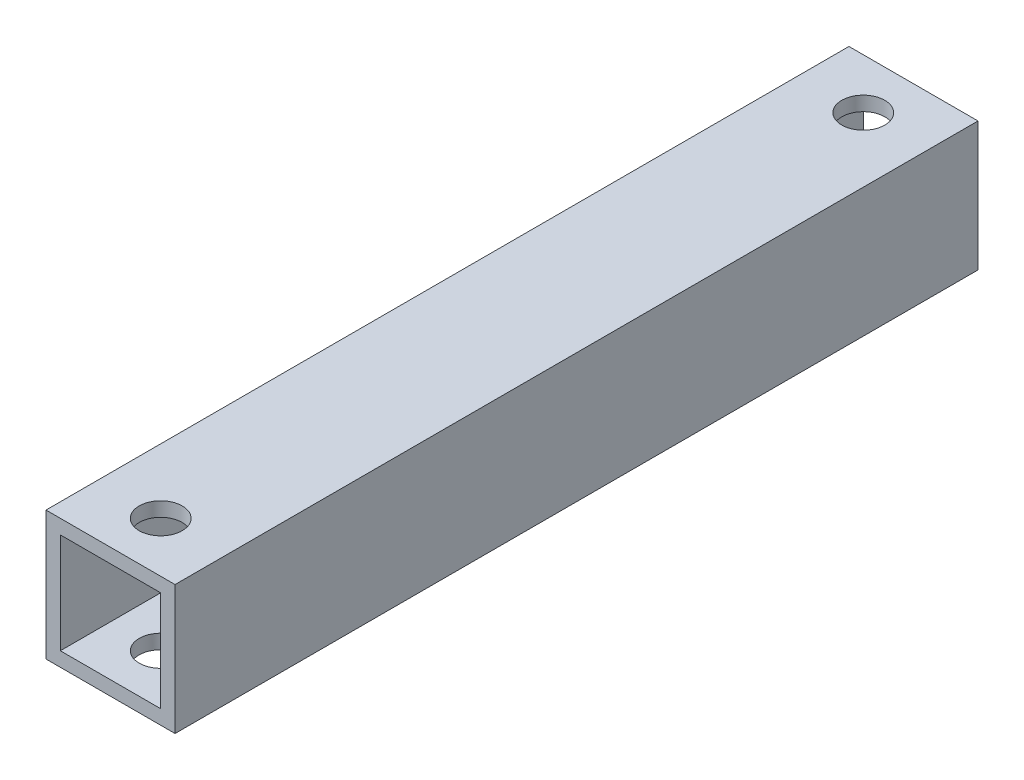
ISO-10303-21;
HEADER;
FILE_DESCRIPTION(('STEP AP214'),'2;1');
FILE_NAME('part.step','',(''),(''),'','','');
FILE_SCHEMA(('AUTOMOTIVE_DESIGN { 1 0 10303 214 1 1 1 1 }'));
ENDSEC;
DATA;
#1=APPLICATION_CONTEXT('core data for automotive mechanical design processes');
#2=APPLICATION_PROTOCOL_DEFINITION('international standard','automotive_design',2000,#1);
#3=PRODUCT_CONTEXT('',#1,'mechanical');
#4=PRODUCT('Part','Part','',(#3));
#5=PRODUCT_RELATED_PRODUCT_CATEGORY('part','',(#4));
#6=PRODUCT_DEFINITION_FORMATION('','',#4);
#7=PRODUCT_DEFINITION_CONTEXT('part definition',#1,'design');
#8=PRODUCT_DEFINITION('design','',#6,#7);
#9=PRODUCT_DEFINITION_SHAPE('','',#8);
#10=(LENGTH_UNIT() NAMED_UNIT(*) SI_UNIT(.MILLI.,.METRE.));
#11=(NAMED_UNIT(*) PLANE_ANGLE_UNIT() SI_UNIT($,.RADIAN.));
#12=(NAMED_UNIT(*) SI_UNIT($,.STERADIAN.) SOLID_ANGLE_UNIT());
#13=UNCERTAINTY_MEASURE_WITH_UNIT(LENGTH_MEASURE(1.E-05),#10,'distance_accuracy_value','');
#14=(GEOMETRIC_REPRESENTATION_CONTEXT(3) GLOBAL_UNCERTAINTY_ASSIGNED_CONTEXT((#13)) GLOBAL_UNIT_ASSIGNED_CONTEXT((#10,
#11,#12)) REPRESENTATION_CONTEXT('',''));
#15=CARTESIAN_POINT('',(0.,0.,0.));
#16=DIRECTION('',(0.,0.,1.));
#17=DIRECTION('',(1.,0.,0.));
#18=AXIS2_PLACEMENT_3D('',#15,#16,#17);
#19=CARTESIAN_POINT('',(4.5,4.5,56.));
#20=DIRECTION('',(-1.,0.,0.));
#21=DIRECTION('',(0.,0.,1.));
#22=AXIS2_PLACEMENT_3D('',#19,#20,#21);
#23=PLANE('',#22);
#24=DIRECTION('',(0.,1.,0.));
#25=VECTOR('',#24,1.);
#26=CARTESIAN_POINT('',(4.5,4.5,0.));
#27=LINE('',#26,#25);
#28=CARTESIAN_POINT('',(4.5,-4.5,0.));
#29=VERTEX_POINT('',#28);
#30=CARTESIAN_POINT('',(4.5,4.5,0.));
#31=VERTEX_POINT('',#30);
#32=EDGE_CURVE('E135',#29,#31,#27,.T.);
#33=ORIENTED_EDGE('',*,*,#32,.T.);
#34=DIRECTION('',(0.,0.,-1.));
#35=VECTOR('',#34,1.);
#36=CARTESIAN_POINT('',(4.5,4.5,56.));
#37=LINE('',#36,#35);
#38=CARTESIAN_POINT('',(4.5,4.5,56.));
#39=VERTEX_POINT('',#38);
#40=EDGE_CURVE('E11',#39,#31,#37,.T.);
#41=ORIENTED_EDGE('',*,*,#40,.F.);
#42=DIRECTION('',(0.,1.,0.));
#43=VECTOR('',#42,1.);
#44=CARTESIAN_POINT('',(4.5,4.5,56.));
#45=LINE('',#44,#43);
#46=CARTESIAN_POINT('',(4.5,-4.5,56.));
#47=VERTEX_POINT('',#46);
#48=EDGE_CURVE('E139',#47,#39,#45,.T.);
#49=ORIENTED_EDGE('',*,*,#48,.F.);
#50=DIRECTION('',(0.,0.,-1.));
#51=VECTOR('',#50,1.);
#52=CARTESIAN_POINT('',(4.5,-4.5,56.));
#53=LINE('',#52,#51);
#54=EDGE_CURVE('E149',#47,#29,#53,.T.);
#55=ORIENTED_EDGE('',*,*,#54,.T.);
#56=EDGE_LOOP('',(#33,#41,#49,#55));
#57=FACE_BOUND('',#56,.T.);
#58=ADVANCED_FACE('F33',(#57),#23,.F.);
#59=CARTESIAN_POINT('',(-4.5,4.5,56.));
#60=DIRECTION('',(0.,-1.,0.));
#61=DIRECTION('',(0.,0.,-1.));
#62=AXIS2_PLACEMENT_3D('',#59,#60,#61);
#63=PLANE('',#62);
#64=CARTESIAN_POINT('',(0.,4.5,3.5));
#65=DIRECTION('',(0.,1.,0.));
#66=DIRECTION('',(0.,0.,1.));
#67=AXIS2_PLACEMENT_3D('',#64,#65,#66);
#68=CIRCLE('',#67,1.5);
#69=CARTESIAN_POINT('',(0.,4.5,5.));
#70=VERTEX_POINT('',#69);
#71=EDGE_CURVE('E166',#70,#70,#68,.T.);
#72=ORIENTED_EDGE('',*,*,#71,.F.);
#73=EDGE_LOOP('',(#72));
#74=FACE_BOUND('',#73,.T.);
#75=CARTESIAN_POINT('',(0.,4.5,52.5));
#76=DIRECTION('',(0.,1.,0.));
#77=DIRECTION('',(0.,0.,1.));
#78=AXIS2_PLACEMENT_3D('',#75,#76,#77);
#79=CIRCLE('',#78,1.5);
#80=CARTESIAN_POINT('',(0.,4.5,54.));
#81=VERTEX_POINT('',#80);
#82=EDGE_CURVE('E173',#81,#81,#79,.T.);
#83=ORIENTED_EDGE('',*,*,#82,.F.);
#84=EDGE_LOOP('',(#83));
#85=FACE_BOUND('',#84,.T.);
#86=DIRECTION('',(-1.,0.,0.));
#87=VECTOR('',#86,1.);
#88=CARTESIAN_POINT('',(-4.5,4.5,0.));
#89=LINE('',#88,#87);
#90=CARTESIAN_POINT('',(-4.5,4.5,0.));
#91=VERTEX_POINT('',#90);
#92=EDGE_CURVE('E152',#31,#91,#89,.T.);
#93=ORIENTED_EDGE('',*,*,#92,.T.);
#94=DIRECTION('',(0.,0.,-1.));
#95=VECTOR('',#94,1.);
#96=CARTESIAN_POINT('',(-4.5,4.5,56.));
#97=LINE('',#96,#95);
#98=CARTESIAN_POINT('',(-4.5,4.5,56.));
#99=VERTEX_POINT('',#98);
#100=EDGE_CURVE('E41',#99,#91,#97,.T.);
#101=ORIENTED_EDGE('',*,*,#100,.F.);
#102=DIRECTION('',(-1.,0.,0.));
#103=VECTOR('',#102,1.);
#104=CARTESIAN_POINT('',(-4.5,4.5,56.));
#105=LINE('',#104,#103);
#106=EDGE_CURVE('E142',#39,#99,#105,.T.);
#107=ORIENTED_EDGE('',*,*,#106,.F.);
#108=ORIENTED_EDGE('',*,*,#40,.T.);
#109=EDGE_LOOP('',(#93,#101,#107,#108));
#110=FACE_BOUND('',#109,.T.);
#111=ADVANCED_FACE('F206',(#74,#85,#110),#63,.F.);
#112=CARTESIAN_POINT('',(-4.5,4.5,56.));
#113=DIRECTION('',(1.,0.,0.));
#114=DIRECTION('',(0.,1.,0.));
#115=AXIS2_PLACEMENT_3D('',#112,#113,#114);
#116=PLANE('',#115);
#117=DIRECTION('',(0.,-1.,0.));
#118=VECTOR('',#117,1.);
#119=CARTESIAN_POINT('',(-4.5,4.5,0.));
#120=LINE('',#119,#118);
#121=CARTESIAN_POINT('',(-4.5,-4.5,0.));
#122=VERTEX_POINT('',#121);
#123=EDGE_CURVE('E154',#91,#122,#120,.T.);
#124=ORIENTED_EDGE('',*,*,#123,.T.);
#125=DIRECTION('',(0.,0.,-1.));
#126=VECTOR('',#125,1.);
#127=CARTESIAN_POINT('',(-4.5,-4.5,56.));
#128=LINE('',#127,#126);
#129=CARTESIAN_POINT('',(-4.5,-4.5,56.));
#130=VERTEX_POINT('',#129);
#131=EDGE_CURVE('E159',#130,#122,#128,.T.);
#132=ORIENTED_EDGE('',*,*,#131,.F.);
#133=DIRECTION('',(0.,-1.,0.));
#134=VECTOR('',#133,1.);
#135=CARTESIAN_POINT('',(-4.5,4.5,56.));
#136=LINE('',#135,#134);
#137=EDGE_CURVE('E145',#99,#130,#136,.T.);
#138=ORIENTED_EDGE('',*,*,#137,.F.);
#139=ORIENTED_EDGE('',*,*,#100,.T.);
#140=EDGE_LOOP('',(#124,#132,#138,#139));
#141=FACE_BOUND('',#140,.T.);
#142=ADVANCED_FACE('F211',(#141),#116,.F.);
#143=CARTESIAN_POINT('',(-4.5,-4.5,56.));
#144=DIRECTION('',(0.,1.,0.));
#145=DIRECTION('',(0.,0.,1.));
#146=AXIS2_PLACEMENT_3D('',#143,#144,#145);
#147=PLANE('',#146);
#148=CARTESIAN_POINT('',(0.,-4.5,3.5));
#149=DIRECTION('',(0.,1.,0.));
#150=DIRECTION('',(0.,0.,1.));
#151=AXIS2_PLACEMENT_3D('',#148,#149,#150);
#152=CIRCLE('',#151,1.5);
#153=CARTESIAN_POINT('',(0.,-4.5,5.));
#154=VERTEX_POINT('',#153);
#155=EDGE_CURVE('E123',#154,#154,#152,.T.);
#156=ORIENTED_EDGE('',*,*,#155,.T.);
#157=EDGE_LOOP('',(#156));
#158=FACE_BOUND('',#157,.T.);
#159=CARTESIAN_POINT('',(0.,-4.5,52.5));
#160=DIRECTION('',(0.,1.,0.));
#161=DIRECTION('',(0.,0.,1.));
#162=AXIS2_PLACEMENT_3D('',#159,#160,#161);
#163=CIRCLE('',#162,1.5);
#164=CARTESIAN_POINT('',(0.,-4.5,54.));
#165=VERTEX_POINT('',#164);
#166=EDGE_CURVE('E170',#165,#165,#163,.T.);
#167=ORIENTED_EDGE('',*,*,#166,.T.);
#168=EDGE_LOOP('',(#167));
#169=FACE_BOUND('',#168,.T.);
#170=DIRECTION('',(1.,0.,0.));
#171=VECTOR('',#170,1.);
#172=CARTESIAN_POINT('',(-4.5,-4.5,0.));
#173=LINE('',#172,#171);
#174=EDGE_CURVE('E143',#122,#29,#173,.T.);
#175=ORIENTED_EDGE('',*,*,#174,.T.);
#176=ORIENTED_EDGE('',*,*,#54,.F.);
#177=DIRECTION('',(1.,0.,0.));
#178=VECTOR('',#177,1.);
#179=CARTESIAN_POINT('',(-4.5,-4.5,56.));
#180=LINE('',#179,#178);
#181=EDGE_CURVE('E147',#130,#47,#180,.T.);
#182=ORIENTED_EDGE('',*,*,#181,.F.);
#183=ORIENTED_EDGE('',*,*,#131,.T.);
#184=EDGE_LOOP('',(#175,#176,#182,#183));
#185=FACE_BOUND('',#184,.T.);
#186=ADVANCED_FACE('F227',(#158,#169,#185),#147,.F.);
#187=CARTESIAN_POINT('',(0.,0.,56.));
#188=DIRECTION('',(0.,0.,1.));
#189=DIRECTION('',(1.,0.,0.));
#190=AXIS2_PLACEMENT_3D('',#187,#188,#189);
#191=PLANE('',#190);
#192=DIRECTION('',(0.,1.,0.));
#193=VECTOR('',#192,1.);
#194=CARTESIAN_POINT('',(3.5,3.5,56.));
#195=LINE('',#194,#193);
#196=CARTESIAN_POINT('',(3.5,-3.5,56.));
#197=VERTEX_POINT('',#196);
#198=CARTESIAN_POINT('',(3.5,3.5,56.));
#199=VERTEX_POINT('',#198);
#200=EDGE_CURVE('E49',#197,#199,#195,.T.);
#201=ORIENTED_EDGE('',*,*,#200,.F.);
#202=DIRECTION('',(1.,0.,0.));
#203=VECTOR('',#202,1.);
#204=CARTESIAN_POINT('',(-3.5,-3.5,56.));
#205=LINE('',#204,#203);
#206=CARTESIAN_POINT('',(-3.5,-3.5,56.));
#207=VERTEX_POINT('',#206);
#208=EDGE_CURVE('E117',#207,#197,#205,.T.);
#209=ORIENTED_EDGE('',*,*,#208,.F.);
#210=DIRECTION('',(0.,-1.,0.));
#211=VECTOR('',#210,1.);
#212=CARTESIAN_POINT('',(-3.5,3.5,56.));
#213=LINE('',#212,#211);
#214=CARTESIAN_POINT('',(-3.5,3.5,56.));
#215=VERTEX_POINT('',#214);
#216=EDGE_CURVE('E120',#215,#207,#213,.T.);
#217=ORIENTED_EDGE('',*,*,#216,.F.);
#218=DIRECTION('',(-1.,0.,0.));
#219=VECTOR('',#218,1.);
#220=CARTESIAN_POINT('',(-3.5,3.5,56.));
#221=LINE('',#220,#219);
#222=EDGE_CURVE('E129',#199,#215,#221,.T.);
#223=ORIENTED_EDGE('',*,*,#222,.F.);
#224=EDGE_LOOP('',(#201,#209,#217,#223));
#225=FACE_BOUND('',#224,.T.);
#226=ORIENTED_EDGE('',*,*,#48,.T.);
#227=ORIENTED_EDGE('',*,*,#106,.T.);
#228=ORIENTED_EDGE('',*,*,#137,.T.);
#229=ORIENTED_EDGE('',*,*,#181,.T.);
#230=EDGE_LOOP('',(#226,#227,#228,#229));
#231=FACE_BOUND('',#230,.T.);
#232=ADVANCED_FACE('F223',(#225,#231),#191,.T.);
#233=CARTESIAN_POINT('',(0.,0.,0.));
#234=DIRECTION('',(0.,0.,1.));
#235=DIRECTION('',(1.,0.,0.));
#236=AXIS2_PLACEMENT_3D('',#233,#234,#235);
#237=PLANE('',#236);
#238=DIRECTION('',(1.,0.,0.));
#239=VECTOR('',#238,1.);
#240=CARTESIAN_POINT('',(-3.5,-3.5,0.));
#241=LINE('',#240,#239);
#242=CARTESIAN_POINT('',(-3.5,-3.5,0.));
#243=VERTEX_POINT('',#242);
#244=CARTESIAN_POINT('',(3.5,-3.5,0.));
#245=VERTEX_POINT('',#244);
#246=EDGE_CURVE('E107',#243,#245,#241,.T.);
#247=ORIENTED_EDGE('',*,*,#246,.T.);
#248=DIRECTION('',(0.,1.,0.));
#249=VECTOR('',#248,1.);
#250=CARTESIAN_POINT('',(3.5,3.5,0.));
#251=LINE('',#250,#249);
#252=CARTESIAN_POINT('',(3.5,3.5,0.));
#253=VERTEX_POINT('',#252);
#254=EDGE_CURVE('E101',#245,#253,#251,.T.);
#255=ORIENTED_EDGE('',*,*,#254,.T.);
#256=DIRECTION('',(-1.,0.,0.));
#257=VECTOR('',#256,1.);
#258=CARTESIAN_POINT('',(-3.5,3.5,0.));
#259=LINE('',#258,#257);
#260=CARTESIAN_POINT('',(-3.5,3.5,0.));
#261=VERTEX_POINT('',#260);
#262=EDGE_CURVE('E110',#253,#261,#259,.T.);
#263=ORIENTED_EDGE('',*,*,#262,.T.);
#264=DIRECTION('',(0.,-1.,0.));
#265=VECTOR('',#264,1.);
#266=CARTESIAN_POINT('',(-3.5,3.5,0.));
#267=LINE('',#266,#265);
#268=EDGE_CURVE('E57',#261,#243,#267,.T.);
#269=ORIENTED_EDGE('',*,*,#268,.T.);
#270=EDGE_LOOP('',(#247,#255,#263,#269));
#271=FACE_BOUND('',#270,.T.);
#272=ORIENTED_EDGE('',*,*,#32,.F.);
#273=ORIENTED_EDGE('',*,*,#174,.F.);
#274=ORIENTED_EDGE('',*,*,#123,.F.);
#275=ORIENTED_EDGE('',*,*,#92,.F.);
#276=EDGE_LOOP('',(#272,#273,#274,#275));
#277=FACE_BOUND('',#276,.T.);
#278=ADVANCED_FACE('F114',(#271,#277),#237,.F.);
#279=CARTESIAN_POINT('',(3.5,3.5,0.));
#280=DIRECTION('',(1.,0.,0.));
#281=DIRECTION('',(0.,1.,0.));
#282=AXIS2_PLACEMENT_3D('',#279,#280,#281);
#283=PLANE('',#282);
#284=ORIENTED_EDGE('',*,*,#200,.T.);
#285=DIRECTION('',(0.,0.,1.));
#286=VECTOR('',#285,1.);
#287=CARTESIAN_POINT('',(3.5,3.5,0.));
#288=LINE('',#287,#286);
#289=EDGE_CURVE('E97',#253,#199,#288,.T.);
#290=ORIENTED_EDGE('',*,*,#289,.F.);
#291=ORIENTED_EDGE('',*,*,#254,.F.);
#292=DIRECTION('',(0.,0.,1.));
#293=VECTOR('',#292,1.);
#294=CARTESIAN_POINT('',(3.5,-3.5,0.));
#295=LINE('',#294,#293);
#296=EDGE_CURVE('E133',#245,#197,#295,.T.);
#297=ORIENTED_EDGE('',*,*,#296,.T.);
#298=EDGE_LOOP('',(#284,#290,#291,#297));
#299=FACE_BOUND('',#298,.T.);
#300=ADVANCED_FACE('F99',(#299),#283,.F.);
#301=CARTESIAN_POINT('',(-3.5,-3.5,0.));
#302=DIRECTION('',(0.,-1.,0.));
#303=DIRECTION('',(0.,0.,-1.));
#304=AXIS2_PLACEMENT_3D('',#301,#302,#303);
#305=PLANE('',#304);
#306=CARTESIAN_POINT('',(0.,-3.5,3.5));
#307=DIRECTION('',(0.,-1.,0.));
#308=DIRECTION('',(0.,0.,-1.));
#309=AXIS2_PLACEMENT_3D('',#306,#307,#308);
#310=CIRCLE('',#309,1.5);
#311=CARTESIAN_POINT('',(0.,-3.5,2.));
#312=VERTEX_POINT('',#311);
#313=EDGE_CURVE('E181',#312,#312,#310,.T.);
#314=ORIENTED_EDGE('',*,*,#313,.T.);
#315=EDGE_LOOP('',(#314));
#316=FACE_BOUND('',#315,.T.);
#317=CARTESIAN_POINT('',(0.,-3.5,52.5));
#318=DIRECTION('',(0.,-1.,0.));
#319=DIRECTION('',(0.,0.,-1.));
#320=AXIS2_PLACEMENT_3D('',#317,#318,#319);
#321=CIRCLE('',#320,1.5);
#322=CARTESIAN_POINT('',(0.,-3.5,51.));
#323=VERTEX_POINT('',#322);
#324=EDGE_CURVE('E165',#323,#323,#321,.T.);
#325=ORIENTED_EDGE('',*,*,#324,.T.);
#326=EDGE_LOOP('',(#325));
#327=FACE_BOUND('',#326,.T.);
#328=ORIENTED_EDGE('',*,*,#208,.T.);
#329=ORIENTED_EDGE('',*,*,#296,.F.);
#330=ORIENTED_EDGE('',*,*,#246,.F.);
#331=DIRECTION('',(0.,0.,1.));
#332=VECTOR('',#331,1.);
#333=CARTESIAN_POINT('',(-3.5,-3.5,0.));
#334=LINE('',#333,#332);
#335=EDGE_CURVE('E136',#243,#207,#334,.T.);
#336=ORIENTED_EDGE('',*,*,#335,.T.);
#337=EDGE_LOOP('',(#328,#329,#330,#336));
#338=FACE_BOUND('',#337,.T.);
#339=ADVANCED_FACE('F244',(#316,#327,#338),#305,.F.);
#340=CARTESIAN_POINT('',(-3.5,3.5,0.));
#341=DIRECTION('',(-1.,0.,0.));
#342=DIRECTION('',(0.,-1.,0.));
#343=AXIS2_PLACEMENT_3D('',#340,#341,#342);
#344=PLANE('',#343);
#345=ORIENTED_EDGE('',*,*,#216,.T.);
#346=ORIENTED_EDGE('',*,*,#335,.F.);
#347=ORIENTED_EDGE('',*,*,#268,.F.);
#348=DIRECTION('',(0.,0.,1.));
#349=VECTOR('',#348,1.);
#350=CARTESIAN_POINT('',(-3.5,3.5,0.));
#351=LINE('',#350,#349);
#352=EDGE_CURVE('E106',#261,#215,#351,.T.);
#353=ORIENTED_EDGE('',*,*,#352,.T.);
#354=EDGE_LOOP('',(#345,#346,#347,#353));
#355=FACE_BOUND('',#354,.T.);
#356=ADVANCED_FACE('F247',(#355),#344,.F.);
#357=CARTESIAN_POINT('',(-3.5,3.5,0.));
#358=DIRECTION('',(0.,1.,0.));
#359=DIRECTION('',(0.,0.,1.));
#360=AXIS2_PLACEMENT_3D('',#357,#358,#359);
#361=PLANE('',#360);
#362=CARTESIAN_POINT('',(0.,3.5,3.5));
#363=DIRECTION('',(0.,1.,0.));
#364=DIRECTION('',(0.,0.,1.));
#365=AXIS2_PLACEMENT_3D('',#362,#363,#364);
#366=CIRCLE('',#365,1.5);
#367=CARTESIAN_POINT('',(0.,3.5,5.));
#368=VERTEX_POINT('',#367);
#369=EDGE_CURVE('E36',#368,#368,#366,.T.);
#370=ORIENTED_EDGE('',*,*,#369,.T.);
#371=EDGE_LOOP('',(#370));
#372=FACE_BOUND('',#371,.T.);
#373=CARTESIAN_POINT('',(0.,3.5,52.5));
#374=DIRECTION('',(0.,1.,0.));
#375=DIRECTION('',(0.,0.,1.));
#376=AXIS2_PLACEMENT_3D('',#373,#374,#375);
#377=CIRCLE('',#376,1.5);
#378=CARTESIAN_POINT('',(0.,3.5,54.));
#379=VERTEX_POINT('',#378);
#380=EDGE_CURVE('E163',#379,#379,#377,.T.);
#381=ORIENTED_EDGE('',*,*,#380,.T.);
#382=EDGE_LOOP('',(#381));
#383=FACE_BOUND('',#382,.T.);
#384=ORIENTED_EDGE('',*,*,#222,.T.);
#385=ORIENTED_EDGE('',*,*,#352,.F.);
#386=ORIENTED_EDGE('',*,*,#262,.F.);
#387=ORIENTED_EDGE('',*,*,#289,.T.);
#388=EDGE_LOOP('',(#384,#385,#386,#387));
#389=FACE_BOUND('',#388,.T.);
#390=ADVANCED_FACE('F111',(#372,#383,#389),#361,.F.);
#391=CARTESIAN_POINT('',(0.,-51.5,52.5));
#392=DIRECTION('',(0.,1.,0.));
#393=DIRECTION('',(0.,0.,1.));
#394=AXIS2_PLACEMENT_3D('',#391,#392,#393);
#395=CYLINDRICAL_SURFACE('',#394,1.5);
#396=ORIENTED_EDGE('',*,*,#82,.T.);
#397=EDGE_LOOP('',(#396));
#398=FACE_BOUND('',#397,.T.);
#399=ORIENTED_EDGE('',*,*,#380,.F.);
#400=EDGE_LOOP('',(#399));
#401=FACE_BOUND('',#400,.T.);
#402=ADVANCED_FACE('F193',(#398,#401),#395,.F.);
#403=CARTESIAN_POINT('',(0.,-51.5,3.5));
#404=DIRECTION('',(0.,1.,0.));
#405=DIRECTION('',(0.,0.,1.));
#406=AXIS2_PLACEMENT_3D('',#403,#404,#405);
#407=CYLINDRICAL_SURFACE('',#406,1.5);
#408=ORIENTED_EDGE('',*,*,#71,.T.);
#409=EDGE_LOOP('',(#408));
#410=FACE_BOUND('',#409,.T.);
#411=ORIENTED_EDGE('',*,*,#369,.F.);
#412=EDGE_LOOP('',(#411));
#413=FACE_BOUND('',#412,.T.);
#414=ADVANCED_FACE('F190',(#410,#413),#407,.F.);
#415=ORIENTED_EDGE('',*,*,#324,.F.);
#416=EDGE_LOOP('',(#415));
#417=FACE_BOUND('',#416,.T.);
#418=ORIENTED_EDGE('',*,*,#166,.F.);
#419=EDGE_LOOP('',(#418));
#420=FACE_BOUND('',#419,.T.);
#421=ADVANCED_FACE('F192',(#417,#420),#395,.F.);
#422=ORIENTED_EDGE('',*,*,#313,.F.);
#423=EDGE_LOOP('',(#422));
#424=FACE_BOUND('',#423,.T.);
#425=ORIENTED_EDGE('',*,*,#155,.F.);
#426=EDGE_LOOP('',(#425));
#427=FACE_BOUND('',#426,.T.);
#428=ADVANCED_FACE('F195',(#424,#427),#407,.F.);
#429=CLOSED_SHELL('',(#58,#111,#142,#186,#232,#278,#300,#339,#356,#390,#402,#414,#421,#428));
#430=MANIFOLD_SOLID_BREP('B2',#429);
#431=ADVANCED_BREP_SHAPE_REPRESENTATION('',(#18,#430),#14);
#432=SHAPE_DEFINITION_REPRESENTATION(#9,#431);
ENDSEC;
END-ISO-10303-21;
